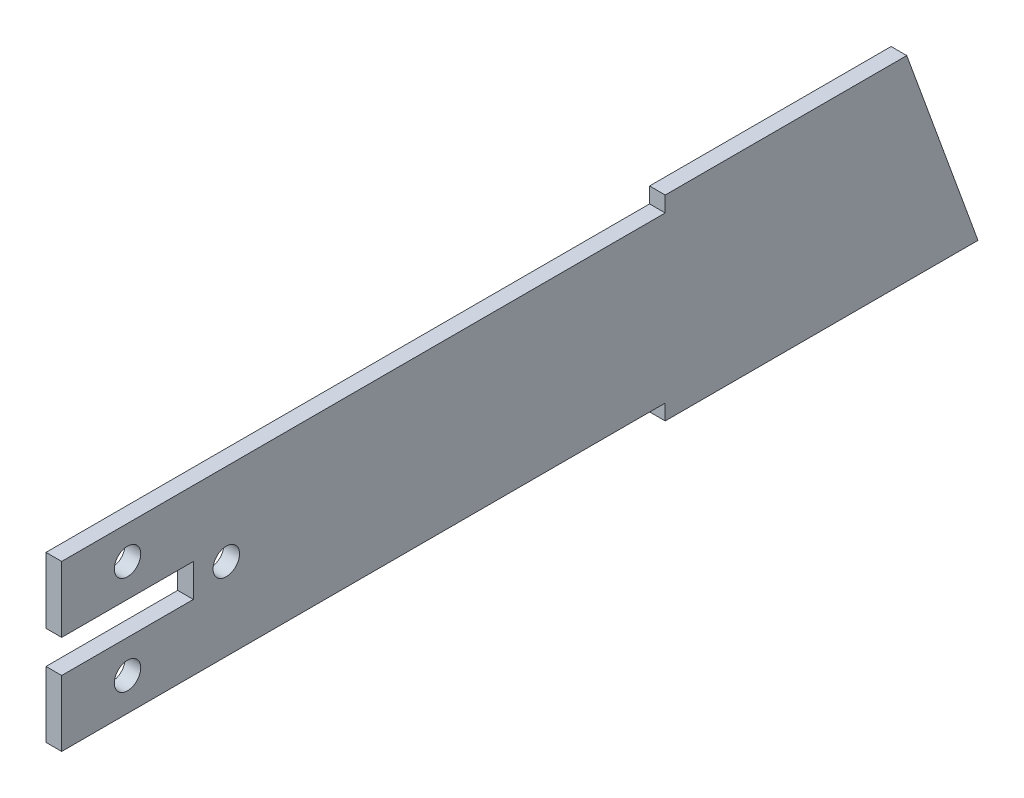
ISO-10303-21;
HEADER;
FILE_DESCRIPTION(('STEP AP214'),'2;1');
FILE_NAME('part.step','',(''),(''),'','','');
FILE_SCHEMA(('AUTOMOTIVE_DESIGN { 1 0 10303 214 1 1 1 1 }'));
ENDSEC;
DATA;
#1=APPLICATION_CONTEXT('core data for automotive mechanical design processes');
#2=APPLICATION_PROTOCOL_DEFINITION('international standard','automotive_design',2000,#1);
#3=PRODUCT_CONTEXT('',#1,'mechanical');
#4=PRODUCT('Part','Part','',(#3));
#5=PRODUCT_RELATED_PRODUCT_CATEGORY('part','',(#4));
#6=PRODUCT_DEFINITION_FORMATION('','',#4);
#7=PRODUCT_DEFINITION_CONTEXT('part definition',#1,'design');
#8=PRODUCT_DEFINITION('design','',#6,#7);
#9=PRODUCT_DEFINITION_SHAPE('','',#8);
#10=(LENGTH_UNIT() NAMED_UNIT(*) SI_UNIT(.MILLI.,.METRE.));
#11=(NAMED_UNIT(*) PLANE_ANGLE_UNIT() SI_UNIT($,.RADIAN.));
#12=(NAMED_UNIT(*) SI_UNIT($,.STERADIAN.) SOLID_ANGLE_UNIT());
#13=UNCERTAINTY_MEASURE_WITH_UNIT(LENGTH_MEASURE(1.E-05),#10,'distance_accuracy_value','');
#14=(GEOMETRIC_REPRESENTATION_CONTEXT(3) GLOBAL_UNCERTAINTY_ASSIGNED_CONTEXT((#13)) GLOBAL_UNIT_ASSIGNED_CONTEXT((#10,
#11,#12)) REPRESENTATION_CONTEXT('',''));
#15=CARTESIAN_POINT('',(0.,0.,0.));
#16=DIRECTION('',(0.,0.,1.));
#17=DIRECTION('',(1.,0.,0.));
#18=AXIS2_PLACEMENT_3D('',#15,#16,#17);
#19=CARTESIAN_POINT('',(3.0226,0.,0.));
#20=DIRECTION('',(-1.,0.,0.));
#21=DIRECTION('',(0.,0.,1.));
#22=AXIS2_PLACEMENT_3D('',#19,#20,#21);
#23=PLANE('',#22);
#24=CARTESIAN_POINT('',(3.0226,25.4,-12.7));
#25=DIRECTION('',(1.,0.,0.));
#26=DIRECTION('',(0.,0.,-1.));
#27=AXIS2_PLACEMENT_3D('',#24,#25,#26);
#28=CIRCLE('',#27,2.5527);
#29=CARTESIAN_POINT('',(3.0226,25.4,-15.2527));
#30=VERTEX_POINT('',#29);
#31=EDGE_CURVE('E451',#30,#30,#28,.T.);
#32=ORIENTED_EDGE('',*,*,#31,.F.);
#33=EDGE_LOOP('',(#32));
#34=FACE_BOUND('',#33,.T.);
#35=CARTESIAN_POINT('',(3.0226,15.875,-31.75));
#36=DIRECTION('',(1.,0.,0.));
#37=DIRECTION('',(0.,0.,-1.));
#38=AXIS2_PLACEMENT_3D('',#35,#36,#37);
#39=CIRCLE('',#38,2.5527);
#40=CARTESIAN_POINT('',(3.0226,15.875,-34.3027));
#41=VERTEX_POINT('',#40);
#42=EDGE_CURVE('E459',#41,#41,#39,.T.);
#43=ORIENTED_EDGE('',*,*,#42,.F.);
#44=EDGE_LOOP('',(#43));
#45=FACE_BOUND('',#44,.T.);
#46=CARTESIAN_POINT('',(3.0226,6.35,-12.7));
#47=DIRECTION('',(1.,0.,0.));
#48=DIRECTION('',(0.,0.,-1.));
#49=AXIS2_PLACEMENT_3D('',#46,#47,#48);
#50=CIRCLE('',#49,2.5527);
#51=CARTESIAN_POINT('',(3.0226,6.35,-15.2527));
#52=VERTEX_POINT('',#51);
#53=EDGE_CURVE('E289',#52,#52,#50,.T.);
#54=ORIENTED_EDGE('',*,*,#53,.F.);
#55=EDGE_LOOP('',(#54));
#56=FACE_BOUND('',#55,.T.);
#57=DIRECTION('',(0.,0.,-1.));
#58=VECTOR('',#57,1.);
#59=CARTESIAN_POINT('',(3.0226,0.,-38.1));
#60=LINE('',#59,#58);
#61=CARTESIAN_POINT('',(3.0226,0.,0.));
#62=VERTEX_POINT('',#61);
#63=CARTESIAN_POINT('',(3.0226,0.,-116.4082));
#64=VERTEX_POINT('',#63);
#65=EDGE_CURVE('E111',#62,#64,#60,.T.);
#66=ORIENTED_EDGE('',*,*,#65,.T.);
#67=DIRECTION('',(0.,-1.,0.));
#68=VECTOR('',#67,1.);
#69=CARTESIAN_POINT('',(3.0226,0.,-116.4082));
#70=LINE('',#69,#68);
#71=CARTESIAN_POINT('',(3.0226,-2.99719999999999,-116.4082));
#72=VERTEX_POINT('',#71);
#73=EDGE_CURVE('E284',#64,#72,#70,.T.);
#74=ORIENTED_EDGE('',*,*,#73,.T.);
#75=DIRECTION('',(0.,0.,-1.));
#76=VECTOR('',#75,1.);
#77=CARTESIAN_POINT('',(3.0226,-2.99719999999999,-116.4082));
#78=LINE('',#77,#76);
#79=CARTESIAN_POINT('',(3.0226,-2.99719999999999,-176.7332));
#80=VERTEX_POINT('',#79);
#81=EDGE_CURVE('E237',#72,#80,#78,.T.);
#82=ORIENTED_EDGE('',*,*,#81,.T.);
#83=DIRECTION('',(0.,0.939692620785909,0.342020143325666));
#84=VECTOR('',#83,1.);
#85=CARTESIAN_POINT('',(3.0226,34.7472,-162.995361889763));
#86=LINE('',#85,#84);
#87=CARTESIAN_POINT('',(3.0226,34.7472,-162.995361889763));
#88=VERTEX_POINT('',#87);
#89=EDGE_CURVE('E256',#80,#88,#86,.T.);
#90=ORIENTED_EDGE('',*,*,#89,.T.);
#91=DIRECTION('',(0.,0.,1.));
#92=VECTOR('',#91,1.);
#93=CARTESIAN_POINT('',(3.0226,34.7472,-116.4082));
#94=LINE('',#93,#92);
#95=CARTESIAN_POINT('',(3.0226,34.7472,-116.4082));
#96=VERTEX_POINT('',#95);
#97=EDGE_CURVE('E252',#88,#96,#94,.T.);
#98=ORIENTED_EDGE('',*,*,#97,.T.);
#99=DIRECTION('',(0.,-1.,0.));
#100=VECTOR('',#99,1.);
#101=CARTESIAN_POINT('',(3.0226,31.75,-116.4082));
#102=LINE('',#101,#100);
#103=CARTESIAN_POINT('',(3.0226,31.75,-116.4082));
#104=VERTEX_POINT('',#103);
#105=EDGE_CURVE('E255',#96,#104,#102,.T.);
#106=ORIENTED_EDGE('',*,*,#105,.T.);
#107=DIRECTION('',(0.,0.,1.));
#108=VECTOR('',#107,1.);
#109=CARTESIAN_POINT('',(3.0226,31.75,-38.1));
#110=LINE('',#109,#108);
#111=CARTESIAN_POINT('',(3.0226,31.75,0.));
#112=VERTEX_POINT('',#111);
#113=EDGE_CURVE('E260',#104,#112,#110,.T.);
#114=ORIENTED_EDGE('',*,*,#113,.T.);
#115=DIRECTION('',(0.,-1.,0.));
#116=VECTOR('',#115,1.);
#117=CARTESIAN_POINT('',(3.0226,19.05,0.));
#118=LINE('',#117,#116);
#119=CARTESIAN_POINT('',(3.0226,19.05,0.));
#120=VERTEX_POINT('',#119);
#121=EDGE_CURVE('E267',#112,#120,#118,.T.);
#122=ORIENTED_EDGE('',*,*,#121,.T.);
#123=DIRECTION('',(0.,0.,-1.));
#124=VECTOR('',#123,1.);
#125=CARTESIAN_POINT('',(3.0226,19.05,-25.4));
#126=LINE('',#125,#124);
#127=CARTESIAN_POINT('',(3.0226,19.05,-25.4));
#128=VERTEX_POINT('',#127);
#129=EDGE_CURVE('E142',#120,#128,#126,.T.);
#130=ORIENTED_EDGE('',*,*,#129,.T.);
#131=DIRECTION('',(0.,-1.,0.));
#132=VECTOR('',#131,1.);
#133=CARTESIAN_POINT('',(3.0226,12.7,-25.4));
#134=LINE('',#133,#132);
#135=CARTESIAN_POINT('',(3.0226,12.7,-25.4));
#136=VERTEX_POINT('',#135);
#137=EDGE_CURVE('E137',#128,#136,#134,.T.);
#138=ORIENTED_EDGE('',*,*,#137,.T.);
#139=DIRECTION('',(0.,0.,1.));
#140=VECTOR('',#139,1.);
#141=CARTESIAN_POINT('',(3.0226,12.7,0.));
#142=LINE('',#141,#140);
#143=CARTESIAN_POINT('',(3.0226,12.7,0.));
#144=VERTEX_POINT('',#143);
#145=EDGE_CURVE('E140',#136,#144,#142,.T.);
#146=ORIENTED_EDGE('',*,*,#145,.T.);
#147=DIRECTION('',(0.,-1.,0.));
#148=VECTOR('',#147,1.);
#149=CARTESIAN_POINT('',(3.0226,0.,0.));
#150=LINE('',#149,#148);
#151=EDGE_CURVE('E57',#144,#62,#150,.T.);
#152=ORIENTED_EDGE('',*,*,#151,.T.);
#153=EDGE_LOOP('',(#66,#74,#82,#90,#98,#106,#114,#122,#130,#138,#146,#152));
#154=FACE_BOUND('',#153,.T.);
#155=ADVANCED_FACE('F39',(#34,#45,#56,#154),#23,.F.);
#156=CARTESIAN_POINT('',(0.,0.,0.));
#157=DIRECTION('',(-1.,0.,0.));
#158=DIRECTION('',(0.,0.,1.));
#159=AXIS2_PLACEMENT_3D('',#156,#157,#158);
#160=PLANE('',#159);
#161=CARTESIAN_POINT('',(0.,25.4,-12.7));
#162=DIRECTION('',(1.,0.,0.));
#163=DIRECTION('',(0.,0.,-1.));
#164=AXIS2_PLACEMENT_3D('',#161,#162,#163);
#165=CIRCLE('',#164,2.5527);
#166=CARTESIAN_POINT('',(0.,25.4,-15.2527));
#167=VERTEX_POINT('',#166);
#168=EDGE_CURVE('E167',#167,#167,#165,.T.);
#169=ORIENTED_EDGE('',*,*,#168,.T.);
#170=EDGE_LOOP('',(#169));
#171=FACE_BOUND('',#170,.T.);
#172=CARTESIAN_POINT('',(0.,15.875,-31.75));
#173=DIRECTION('',(1.,0.,0.));
#174=DIRECTION('',(0.,0.,-1.));
#175=AXIS2_PLACEMENT_3D('',#172,#173,#174);
#176=CIRCLE('',#175,2.5527);
#177=CARTESIAN_POINT('',(0.,15.875,-34.3027));
#178=VERTEX_POINT('',#177);
#179=EDGE_CURVE('E453',#178,#178,#176,.T.);
#180=ORIENTED_EDGE('',*,*,#179,.T.);
#181=EDGE_LOOP('',(#180));
#182=FACE_BOUND('',#181,.T.);
#183=CARTESIAN_POINT('',(0.,6.35,-12.7));
#184=DIRECTION('',(1.,0.,0.));
#185=DIRECTION('',(0.,0.,-1.));
#186=AXIS2_PLACEMENT_3D('',#183,#184,#185);
#187=CIRCLE('',#186,2.5527);
#188=CARTESIAN_POINT('',(0.,6.35,-15.2527));
#189=VERTEX_POINT('',#188);
#190=EDGE_CURVE('E464',#189,#189,#187,.T.);
#191=ORIENTED_EDGE('',*,*,#190,.T.);
#192=EDGE_LOOP('',(#191));
#193=FACE_BOUND('',#192,.T.);
#194=DIRECTION('',(0.,0.,-1.));
#195=VECTOR('',#194,1.);
#196=CARTESIAN_POINT('',(0.,0.,-116.4082));
#197=LINE('',#196,#195);
#198=CARTESIAN_POINT('',(0.,0.,0.));
#199=VERTEX_POINT('',#198);
#200=CARTESIAN_POINT('',(0.,0.,-116.4082));
#201=VERTEX_POINT('',#200);
#202=EDGE_CURVE('E105',#199,#201,#197,.T.);
#203=ORIENTED_EDGE('',*,*,#202,.F.);
#204=DIRECTION('',(0.,-1.,0.));
#205=VECTOR('',#204,1.);
#206=CARTESIAN_POINT('',(0.,0.,0.));
#207=LINE('',#206,#205);
#208=CARTESIAN_POINT('',(0.,12.7,0.));
#209=VERTEX_POINT('',#208);
#210=EDGE_CURVE('E196',#209,#199,#207,.T.);
#211=ORIENTED_EDGE('',*,*,#210,.F.);
#212=DIRECTION('',(0.,0.,1.));
#213=VECTOR('',#212,1.);
#214=CARTESIAN_POINT('',(0.,12.7,0.));
#215=LINE('',#214,#213);
#216=CARTESIAN_POINT('',(0.,12.7,-25.4));
#217=VERTEX_POINT('',#216);
#218=EDGE_CURVE('E98',#217,#209,#215,.T.);
#219=ORIENTED_EDGE('',*,*,#218,.F.);
#220=DIRECTION('',(0.,-1.,0.));
#221=VECTOR('',#220,1.);
#222=CARTESIAN_POINT('',(0.,12.7,-25.4));
#223=LINE('',#222,#221);
#224=CARTESIAN_POINT('',(0.,19.05,-25.4));
#225=VERTEX_POINT('',#224);
#226=EDGE_CURVE('E151',#225,#217,#223,.T.);
#227=ORIENTED_EDGE('',*,*,#226,.F.);
#228=DIRECTION('',(0.,0.,-1.));
#229=VECTOR('',#228,1.);
#230=CARTESIAN_POINT('',(0.,19.05,-25.4));
#231=LINE('',#230,#229);
#232=CARTESIAN_POINT('',(0.,19.05,0.));
#233=VERTEX_POINT('',#232);
#234=EDGE_CURVE('E189',#233,#225,#231,.T.);
#235=ORIENTED_EDGE('',*,*,#234,.F.);
#236=DIRECTION('',(0.,-1.,0.));
#237=VECTOR('',#236,1.);
#238=CARTESIAN_POINT('',(0.,19.05,0.));
#239=LINE('',#238,#237);
#240=CARTESIAN_POINT('',(0.,31.75,0.));
#241=VERTEX_POINT('',#240);
#242=EDGE_CURVE('E186',#241,#233,#239,.T.);
#243=ORIENTED_EDGE('',*,*,#242,.F.);
#244=DIRECTION('',(0.,0.,1.));
#245=VECTOR('',#244,1.);
#246=CARTESIAN_POINT('',(0.,31.75,0.));
#247=LINE('',#246,#245);
#248=CARTESIAN_POINT('',(0.,31.75,-116.4082));
#249=VERTEX_POINT('',#248);
#250=EDGE_CURVE('E183',#249,#241,#247,.T.);
#251=ORIENTED_EDGE('',*,*,#250,.F.);
#252=DIRECTION('',(0.,-1.,0.));
#253=VECTOR('',#252,1.);
#254=CARTESIAN_POINT('',(0.,31.75,-116.4082));
#255=LINE('',#254,#253);
#256=CARTESIAN_POINT('',(0.,34.7472,-116.4082));
#257=VERTEX_POINT('',#256);
#258=EDGE_CURVE('E179',#257,#249,#255,.T.);
#259=ORIENTED_EDGE('',*,*,#258,.F.);
#260=DIRECTION('',(0.,0.,1.));
#261=VECTOR('',#260,1.);
#262=CARTESIAN_POINT('',(0.,34.7472,-116.4082));
#263=LINE('',#262,#261);
#264=CARTESIAN_POINT('',(0.,34.7472,-162.995361889763));
#265=VERTEX_POINT('',#264);
#266=EDGE_CURVE('E176',#265,#257,#263,.T.);
#267=ORIENTED_EDGE('',*,*,#266,.F.);
#268=DIRECTION('',(0.,0.939692620785909,0.342020143325666));
#269=VECTOR('',#268,1.);
#270=CARTESIAN_POINT('',(0.,34.7472,-162.995361889763));
#271=LINE('',#270,#269);
#272=CARTESIAN_POINT('',(0.,-2.99719999999999,-176.7332));
#273=VERTEX_POINT('',#272);
#274=EDGE_CURVE('E173',#273,#265,#271,.T.);
#275=ORIENTED_EDGE('',*,*,#274,.F.);
#276=DIRECTION('',(0.,0.,-1.));
#277=VECTOR('',#276,1.);
#278=CARTESIAN_POINT('',(0.,-2.99719999999999,-116.4082));
#279=LINE('',#278,#277);
#280=CARTESIAN_POINT('',(0.,-2.99719999999999,-116.4082));
#281=VERTEX_POINT('',#280);
#282=EDGE_CURVE('E170',#281,#273,#279,.T.);
#283=ORIENTED_EDGE('',*,*,#282,.F.);
#284=DIRECTION('',(0.,-1.,0.));
#285=VECTOR('',#284,1.);
#286=CARTESIAN_POINT('',(0.,0.,-116.4082));
#287=LINE('',#286,#285);
#288=EDGE_CURVE('E166',#201,#281,#287,.T.);
#289=ORIENTED_EDGE('',*,*,#288,.F.);
#290=EDGE_LOOP('',(#203,#211,#219,#227,#235,#243,#251,#259,#267,#275,#283,#289));
#291=FACE_BOUND('',#290,.T.);
#292=ADVANCED_FACE('F241',(#171,#182,#193,#291),#160,.T.);
#293=CARTESIAN_POINT('',(3.0226,0.,-116.4082));
#294=DIRECTION('',(0.,1.,0.));
#295=DIRECTION('',(0.,0.,1.));
#296=AXIS2_PLACEMENT_3D('',#293,#294,#295);
#297=PLANE('',#296);
#298=ORIENTED_EDGE('',*,*,#202,.T.);
#299=DIRECTION('',(-1.,0.,0.));
#300=VECTOR('',#299,1.);
#301=CARTESIAN_POINT('',(3.0226,0.,-116.4082));
#302=LINE('',#301,#300);
#303=EDGE_CURVE('E11',#64,#201,#302,.T.);
#304=ORIENTED_EDGE('',*,*,#303,.F.);
#305=ORIENTED_EDGE('',*,*,#65,.F.);
#306=DIRECTION('',(-1.,0.,0.));
#307=VECTOR('',#306,1.);
#308=CARTESIAN_POINT('',(3.0226,0.,0.));
#309=LINE('',#308,#307);
#310=EDGE_CURVE('E160',#62,#199,#309,.T.);
#311=ORIENTED_EDGE('',*,*,#310,.T.);
#312=EDGE_LOOP('',(#298,#304,#305,#311));
#313=FACE_BOUND('',#312,.T.);
#314=ADVANCED_FACE('F41',(#313),#297,.F.);
#315=CARTESIAN_POINT('',(3.0226,0.,-116.4082));
#316=DIRECTION('',(0.,0.,-1.));
#317=DIRECTION('',(-1.,0.,0.));
#318=AXIS2_PLACEMENT_3D('',#315,#316,#317);
#319=PLANE('',#318);
#320=ORIENTED_EDGE('',*,*,#288,.T.);
#321=DIRECTION('',(-1.,0.,0.));
#322=VECTOR('',#321,1.);
#323=CARTESIAN_POINT('',(3.0226,-2.99719999999999,-116.4082));
#324=LINE('',#323,#322);
#325=EDGE_CURVE('E49',#72,#281,#324,.T.);
#326=ORIENTED_EDGE('',*,*,#325,.F.);
#327=ORIENTED_EDGE('',*,*,#73,.F.);
#328=ORIENTED_EDGE('',*,*,#303,.T.);
#329=EDGE_LOOP('',(#320,#326,#327,#328));
#330=FACE_BOUND('',#329,.T.);
#331=ADVANCED_FACE('F292',(#330),#319,.F.);
#332=CARTESIAN_POINT('',(3.0226,-2.99719999999999,-116.4082));
#333=DIRECTION('',(0.,1.,0.));
#334=DIRECTION('',(0.,0.,1.));
#335=AXIS2_PLACEMENT_3D('',#332,#333,#334);
#336=PLANE('',#335);
#337=ORIENTED_EDGE('',*,*,#282,.T.);
#338=DIRECTION('',(-1.,0.,0.));
#339=VECTOR('',#338,1.);
#340=CARTESIAN_POINT('',(3.0226,-2.99719999999999,-176.7332));
#341=LINE('',#340,#339);
#342=EDGE_CURVE('E226',#80,#273,#341,.T.);
#343=ORIENTED_EDGE('',*,*,#342,.F.);
#344=ORIENTED_EDGE('',*,*,#81,.F.);
#345=ORIENTED_EDGE('',*,*,#325,.T.);
#346=EDGE_LOOP('',(#337,#343,#344,#345));
#347=FACE_BOUND('',#346,.T.);
#348=ADVANCED_FACE('F235',(#347),#336,.F.);
#349=CARTESIAN_POINT('',(3.0226,34.7472,-162.995361889763));
#350=DIRECTION('',(0.,-0.342020143325666,0.939692620785909));
#351=DIRECTION('',(0.,-0.939692620785909,-0.342020143325666));
#352=AXIS2_PLACEMENT_3D('',#349,#350,#351);
#353=PLANE('',#352);
#354=ORIENTED_EDGE('',*,*,#274,.T.);
#355=DIRECTION('',(-1.,0.,0.));
#356=VECTOR('',#355,1.);
#357=CARTESIAN_POINT('',(3.0226,34.7472,-162.995361889763));
#358=LINE('',#357,#356);
#359=EDGE_CURVE('E222',#88,#265,#358,.T.);
#360=ORIENTED_EDGE('',*,*,#359,.F.);
#361=ORIENTED_EDGE('',*,*,#89,.F.);
#362=ORIENTED_EDGE('',*,*,#342,.T.);
#363=EDGE_LOOP('',(#354,#360,#361,#362));
#364=FACE_BOUND('',#363,.T.);
#365=ADVANCED_FACE('F246',(#364),#353,.F.);
#366=CARTESIAN_POINT('',(3.0226,34.7472,-116.4082));
#367=DIRECTION('',(0.,-1.,0.));
#368=DIRECTION('',(0.,0.,-1.));
#369=AXIS2_PLACEMENT_3D('',#366,#367,#368);
#370=PLANE('',#369);
#371=ORIENTED_EDGE('',*,*,#266,.T.);
#372=DIRECTION('',(-1.,0.,0.));
#373=VECTOR('',#372,1.);
#374=CARTESIAN_POINT('',(3.0226,34.7472,-116.4082));
#375=LINE('',#374,#373);
#376=EDGE_CURVE('E218',#96,#257,#375,.T.);
#377=ORIENTED_EDGE('',*,*,#376,.F.);
#378=ORIENTED_EDGE('',*,*,#97,.F.);
#379=ORIENTED_EDGE('',*,*,#359,.T.);
#380=EDGE_LOOP('',(#371,#377,#378,#379));
#381=FACE_BOUND('',#380,.T.);
#382=ADVANCED_FACE('F250',(#381),#370,.F.);
#383=CARTESIAN_POINT('',(3.0226,31.75,-116.4082));
#384=DIRECTION('',(0.,0.,-1.));
#385=DIRECTION('',(-1.,0.,0.));
#386=AXIS2_PLACEMENT_3D('',#383,#384,#385);
#387=PLANE('',#386);
#388=ORIENTED_EDGE('',*,*,#258,.T.);
#389=DIRECTION('',(-1.,0.,0.));
#390=VECTOR('',#389,1.);
#391=CARTESIAN_POINT('',(3.0226,31.75,-116.4082));
#392=LINE('',#391,#390);
#393=EDGE_CURVE('E214',#104,#249,#392,.T.);
#394=ORIENTED_EDGE('',*,*,#393,.F.);
#395=ORIENTED_EDGE('',*,*,#105,.F.);
#396=ORIENTED_EDGE('',*,*,#376,.T.);
#397=EDGE_LOOP('',(#388,#394,#395,#396));
#398=FACE_BOUND('',#397,.T.);
#399=ADVANCED_FACE('F326',(#398),#387,.F.);
#400=CARTESIAN_POINT('',(3.0226,31.75,0.));
#401=DIRECTION('',(0.,-1.,0.));
#402=DIRECTION('',(0.,0.,-1.));
#403=AXIS2_PLACEMENT_3D('',#400,#401,#402);
#404=PLANE('',#403);
#405=ORIENTED_EDGE('',*,*,#250,.T.);
#406=DIRECTION('',(-1.,0.,0.));
#407=VECTOR('',#406,1.);
#408=CARTESIAN_POINT('',(3.0226,31.75,0.));
#409=LINE('',#408,#407);
#410=EDGE_CURVE('E210',#112,#241,#409,.T.);
#411=ORIENTED_EDGE('',*,*,#410,.F.);
#412=ORIENTED_EDGE('',*,*,#113,.F.);
#413=ORIENTED_EDGE('',*,*,#393,.T.);
#414=EDGE_LOOP('',(#405,#411,#412,#413));
#415=FACE_BOUND('',#414,.T.);
#416=ADVANCED_FACE('F323',(#415),#404,.F.);
#417=CARTESIAN_POINT('',(3.0226,19.05,0.));
#418=DIRECTION('',(0.,0.,-1.));
#419=DIRECTION('',(-1.,0.,0.));
#420=AXIS2_PLACEMENT_3D('',#417,#418,#419);
#421=PLANE('',#420);
#422=ORIENTED_EDGE('',*,*,#242,.T.);
#423=DIRECTION('',(-1.,0.,0.));
#424=VECTOR('',#423,1.);
#425=CARTESIAN_POINT('',(3.0226,19.05,0.));
#426=LINE('',#425,#424);
#427=EDGE_CURVE('E206',#120,#233,#426,.T.);
#428=ORIENTED_EDGE('',*,*,#427,.F.);
#429=ORIENTED_EDGE('',*,*,#121,.F.);
#430=ORIENTED_EDGE('',*,*,#410,.T.);
#431=EDGE_LOOP('',(#422,#428,#429,#430));
#432=FACE_BOUND('',#431,.T.);
#433=ADVANCED_FACE('F275',(#432),#421,.F.);
#434=CARTESIAN_POINT('',(3.0226,19.05,-25.4));
#435=DIRECTION('',(0.,1.,0.));
#436=DIRECTION('',(0.,0.,1.));
#437=AXIS2_PLACEMENT_3D('',#434,#435,#436);
#438=PLANE('',#437);
#439=ORIENTED_EDGE('',*,*,#234,.T.);
#440=DIRECTION('',(-1.,0.,0.));
#441=VECTOR('',#440,1.);
#442=CARTESIAN_POINT('',(3.0226,19.05,-25.4));
#443=LINE('',#442,#441);
#444=EDGE_CURVE('E153',#128,#225,#443,.T.);
#445=ORIENTED_EDGE('',*,*,#444,.F.);
#446=ORIENTED_EDGE('',*,*,#129,.F.);
#447=ORIENTED_EDGE('',*,*,#427,.T.);
#448=EDGE_LOOP('',(#439,#445,#446,#447));
#449=FACE_BOUND('',#448,.T.);
#450=ADVANCED_FACE('F279',(#449),#438,.F.);
#451=CARTESIAN_POINT('',(3.0226,12.7,-25.4));
#452=DIRECTION('',(0.,0.,-1.));
#453=DIRECTION('',(-1.,0.,0.));
#454=AXIS2_PLACEMENT_3D('',#451,#452,#453);
#455=PLANE('',#454);
#456=ORIENTED_EDGE('',*,*,#226,.T.);
#457=DIRECTION('',(-1.,0.,0.));
#458=VECTOR('',#457,1.);
#459=CARTESIAN_POINT('',(3.0226,12.7,-25.4));
#460=LINE('',#459,#458);
#461=EDGE_CURVE('E148',#136,#217,#460,.T.);
#462=ORIENTED_EDGE('',*,*,#461,.F.);
#463=ORIENTED_EDGE('',*,*,#137,.F.);
#464=ORIENTED_EDGE('',*,*,#444,.T.);
#465=EDGE_LOOP('',(#456,#462,#463,#464));
#466=FACE_BOUND('',#465,.T.);
#467=ADVANCED_FACE('F149',(#466),#455,.F.);
#468=CARTESIAN_POINT('',(3.0226,12.7,0.));
#469=DIRECTION('',(0.,-1.,0.));
#470=DIRECTION('',(0.,0.,-1.));
#471=AXIS2_PLACEMENT_3D('',#468,#469,#470);
#472=PLANE('',#471);
#473=ORIENTED_EDGE('',*,*,#218,.T.);
#474=DIRECTION('',(-1.,0.,0.));
#475=VECTOR('',#474,1.);
#476=CARTESIAN_POINT('',(3.0226,12.7,0.));
#477=LINE('',#476,#475);
#478=EDGE_CURVE('E154',#144,#209,#477,.T.);
#479=ORIENTED_EDGE('',*,*,#478,.F.);
#480=ORIENTED_EDGE('',*,*,#145,.F.);
#481=ORIENTED_EDGE('',*,*,#461,.T.);
#482=EDGE_LOOP('',(#473,#479,#480,#481));
#483=FACE_BOUND('',#482,.T.);
#484=ADVANCED_FACE('F156',(#483),#472,.F.);
#485=CARTESIAN_POINT('',(3.0226,0.,0.));
#486=DIRECTION('',(0.,0.,-1.));
#487=DIRECTION('',(-1.,0.,0.));
#488=AXIS2_PLACEMENT_3D('',#485,#486,#487);
#489=PLANE('',#488);
#490=ORIENTED_EDGE('',*,*,#210,.T.);
#491=ORIENTED_EDGE('',*,*,#310,.F.);
#492=ORIENTED_EDGE('',*,*,#151,.F.);
#493=ORIENTED_EDGE('',*,*,#478,.T.);
#494=EDGE_LOOP('',(#490,#491,#492,#493));
#495=FACE_BOUND('',#494,.T.);
#496=ADVANCED_FACE('F281',(#495),#489,.F.);
#497=CARTESIAN_POINT('',(0.,6.35,-12.7));
#498=DIRECTION('',(1.,0.,0.));
#499=DIRECTION('',(0.,0.,-1.));
#500=AXIS2_PLACEMENT_3D('',#497,#498,#499);
#501=CYLINDRICAL_SURFACE('',#500,2.5527);
#502=ORIENTED_EDGE('',*,*,#190,.F.);
#503=EDGE_LOOP('',(#502));
#504=FACE_BOUND('',#503,.T.);
#505=ORIENTED_EDGE('',*,*,#53,.T.);
#506=EDGE_LOOP('',(#505));
#507=FACE_BOUND('',#506,.T.);
#508=ADVANCED_FACE('F310',(#504,#507),#501,.F.);
#509=CARTESIAN_POINT('',(0.,15.875,-31.75));
#510=DIRECTION('',(1.,0.,0.));
#511=DIRECTION('',(0.,0.,-1.));
#512=AXIS2_PLACEMENT_3D('',#509,#510,#511);
#513=CYLINDRICAL_SURFACE('',#512,2.5527);
#514=ORIENTED_EDGE('',*,*,#179,.F.);
#515=EDGE_LOOP('',(#514));
#516=FACE_BOUND('',#515,.T.);
#517=ORIENTED_EDGE('',*,*,#42,.T.);
#518=EDGE_LOOP('',(#517));
#519=FACE_BOUND('',#518,.T.);
#520=ADVANCED_FACE('F376',(#516,#519),#513,.F.);
#521=CARTESIAN_POINT('',(0.,25.4,-12.7));
#522=DIRECTION('',(1.,0.,0.));
#523=DIRECTION('',(0.,0.,-1.));
#524=AXIS2_PLACEMENT_3D('',#521,#522,#523);
#525=CYLINDRICAL_SURFACE('',#524,2.5527);
#526=ORIENTED_EDGE('',*,*,#168,.F.);
#527=EDGE_LOOP('',(#526));
#528=FACE_BOUND('',#527,.T.);
#529=ORIENTED_EDGE('',*,*,#31,.T.);
#530=EDGE_LOOP('',(#529));
#531=FACE_BOUND('',#530,.T.);
#532=ADVANCED_FACE('F384',(#528,#531),#525,.F.);
#533=CLOSED_SHELL('',(#155,#292,#314,#331,#348,#365,#382,#399,#416,#433,#450,#467,#484,#496,
#508,#520,#532));
#534=MANIFOLD_SOLID_BREP('B2',#533);
#535=ADVANCED_BREP_SHAPE_REPRESENTATION('',(#18,#534),#14);
#536=SHAPE_DEFINITION_REPRESENTATION(#9,#535);
ENDSEC;
END-ISO-10303-21;
